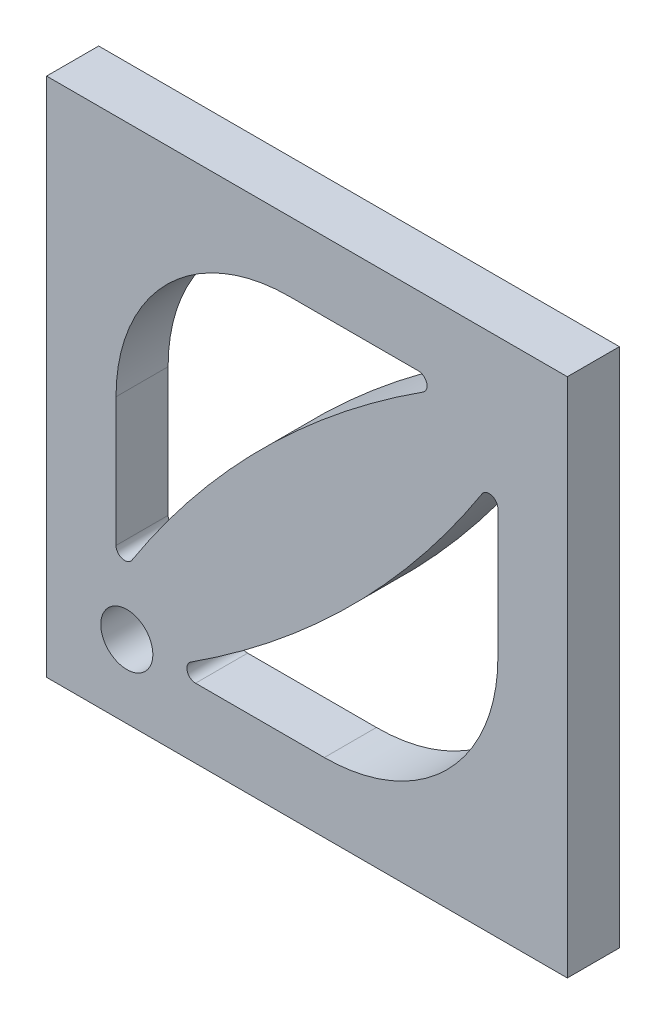
ISO-10303-21;
HEADER;
FILE_DESCRIPTION(('STEP AP214'),'2;1');
FILE_NAME('part.step','',(''),(''),'','','');
FILE_SCHEMA(('AUTOMOTIVE_DESIGN { 1 0 10303 214 1 1 1 1 }'));
ENDSEC;
DATA;
#1=APPLICATION_CONTEXT('core data for automotive mechanical design processes');
#2=APPLICATION_PROTOCOL_DEFINITION('international standard','automotive_design',2000,#1);
#3=PRODUCT_CONTEXT('',#1,'mechanical');
#4=PRODUCT('Part','Part','',(#3));
#5=PRODUCT_RELATED_PRODUCT_CATEGORY('part','',(#4));
#6=PRODUCT_DEFINITION_FORMATION('','',#4);
#7=PRODUCT_DEFINITION_CONTEXT('part definition',#1,'design');
#8=PRODUCT_DEFINITION('design','',#6,#7);
#9=PRODUCT_DEFINITION_SHAPE('','',#8);
#10=(LENGTH_UNIT() NAMED_UNIT(*) SI_UNIT(.MILLI.,.METRE.));
#11=(NAMED_UNIT(*) PLANE_ANGLE_UNIT() SI_UNIT($,.RADIAN.));
#12=(NAMED_UNIT(*) SI_UNIT($,.STERADIAN.) SOLID_ANGLE_UNIT());
#13=UNCERTAINTY_MEASURE_WITH_UNIT(LENGTH_MEASURE(1.E-05),#10,'distance_accuracy_value','');
#14=(GEOMETRIC_REPRESENTATION_CONTEXT(3) GLOBAL_UNCERTAINTY_ASSIGNED_CONTEXT((#13)) GLOBAL_UNIT_ASSIGNED_CONTEXT((#10,
#11,#12)) REPRESENTATION_CONTEXT('',''));
#15=CARTESIAN_POINT('',(0.,0.,0.));
#16=DIRECTION('',(0.,0.,1.));
#17=DIRECTION('',(1.,0.,0.));
#18=AXIS2_PLACEMENT_3D('',#15,#16,#17);
#19=CARTESIAN_POINT('',(0.,0.,3.));
#20=DIRECTION('',(0.,0.,1.));
#21=DIRECTION('',(1.,0.,0.));
#22=AXIS2_PLACEMENT_3D('',#19,#20,#21);
#23=PLANE('',#22);
#24=CARTESIAN_POINT('',(-10.3783024191752,-10.7986075015717,3.));
#25=DIRECTION('',(0.,0.,1.));
#26=DIRECTION('',(1.,0.,0.));
#27=AXIS2_PLACEMENT_3D('',#24,#25,#26);
#28=CIRCLE('',#27,1.5);
#29=CARTESIAN_POINT('',(-8.87830241917519,-10.7986075015717,3.));
#30=VERTEX_POINT('',#29);
#31=EDGE_CURVE('E439',#30,#30,#28,.T.);
#32=ORIENTED_EDGE('',*,*,#31,.F.);
#33=EDGE_LOOP('',(#32));
#34=FACE_BOUND('',#33,.T.);
#35=DIRECTION('',(0.,1.,0.));
#36=VECTOR('',#35,1.);
#37=CARTESIAN_POINT('',(15.,15.,3.));
#38=LINE('',#37,#36);
#39=CARTESIAN_POINT('',(15.,-15.,3.));
#40=VERTEX_POINT('',#39);
#41=CARTESIAN_POINT('',(15.,15.,3.));
#42=VERTEX_POINT('',#41);
#43=EDGE_CURVE('E290',#40,#42,#38,.T.);
#44=ORIENTED_EDGE('',*,*,#43,.T.);
#45=DIRECTION('',(-1.,0.,0.));
#46=VECTOR('',#45,1.);
#47=CARTESIAN_POINT('',(-15.,15.,3.));
#48=LINE('',#47,#46);
#49=CARTESIAN_POINT('',(-15.,15.,3.));
#50=VERTEX_POINT('',#49);
#51=EDGE_CURVE('E294',#42,#50,#48,.T.);
#52=ORIENTED_EDGE('',*,*,#51,.T.);
#53=DIRECTION('',(0.,-1.,0.));
#54=VECTOR('',#53,1.);
#55=CARTESIAN_POINT('',(-15.,15.,3.));
#56=LINE('',#55,#54);
#57=CARTESIAN_POINT('',(-15.,-15.,3.));
#58=VERTEX_POINT('',#57);
#59=EDGE_CURVE('E298',#50,#58,#56,.T.);
#60=ORIENTED_EDGE('',*,*,#59,.T.);
#61=DIRECTION('',(1.,0.,0.));
#62=VECTOR('',#61,1.);
#63=CARTESIAN_POINT('',(-15.,-15.,3.));
#64=LINE('',#63,#62);
#65=EDGE_CURVE('E301',#58,#40,#64,.T.);
#66=ORIENTED_EDGE('',*,*,#65,.T.);
#67=EDGE_LOOP('',(#44,#52,#60,#66));
#68=FACE_BOUND('',#67,.T.);
#69=DIRECTION('',(0.,1.,0.));
#70=VECTOR('',#69,1.);
#71=CARTESIAN_POINT('',(11.,-0.999999999999923,3.));
#72=LINE('',#71,#70);
#73=CARTESIAN_POINT('',(11.,-0.999999999999923,3.));
#74=VERTEX_POINT('',#73);
#75=CARTESIAN_POINT('',(11.,6.4184989585451,3.));
#76=VERTEX_POINT('',#75);
#77=EDGE_CURVE('E230',#74,#76,#72,.T.);
#78=ORIENTED_EDGE('',*,*,#77,.F.);
#79=CARTESIAN_POINT('',(0.999999999999994,-0.999999999999996,3.));
#80=DIRECTION('',(0.,0.,1.));
#81=DIRECTION('',(1.,0.,0.));
#82=AXIS2_PLACEMENT_3D('',#79,#80,#81);
#83=CIRCLE('',#82,10.);
#84=CARTESIAN_POINT('',(0.999999999999921,-11.,3.));
#85=VERTEX_POINT('',#84);
#86=EDGE_CURVE('E227',#85,#74,#83,.T.);
#87=ORIENTED_EDGE('',*,*,#86,.F.);
#88=DIRECTION('',(1.,0.,0.));
#89=VECTOR('',#88,1.);
#90=CARTESIAN_POINT('',(-6.41849895854493,-11.,3.));
#91=LINE('',#90,#89);
#92=CARTESIAN_POINT('',(-6.41849895854493,-11.,3.));
#93=VERTEX_POINT('',#92);
#94=EDGE_CURVE('E244',#93,#85,#91,.T.);
#95=ORIENTED_EDGE('',*,*,#94,.F.);
#96=CARTESIAN_POINT('',(-6.41849895854493,-10.5,3.));
#97=DIRECTION('',(0.,0.,1.));
#98=DIRECTION('',(-1.,0.,0.));
#99=AXIS2_PLACEMENT_3D('',#96,#97,#98);
#100=CIRCLE('',#99,0.500000000000002);
#101=CARTESIAN_POINT('',(-6.68885237713846,-10.0793944495673,3.));
#102=VERTEX_POINT('',#101);
#103=EDGE_CURVE('E240',#102,#93,#100,.T.);
#104=ORIENTED_EDGE('',*,*,#103,.F.);
#105=CARTESIAN_POINT('',(-36.8604898636055,36.8604898636052,3.));
#106=DIRECTION('',(0.,0.,-1.));
#107=DIRECTION('',(-1.,0.,0.));
#108=AXIS2_PLACEMENT_3D('',#105,#106,#107);
#109=CIRCLE('',#108,55.8003624356402);
#110=CARTESIAN_POINT('',(10.0793944495673,6.68885237713862,3.));
#111=VERTEX_POINT('',#110);
#112=EDGE_CURVE('E237',#111,#102,#109,.T.);
#113=ORIENTED_EDGE('',*,*,#112,.F.);
#114=CARTESIAN_POINT('',(10.5,6.4184989585451,3.));
#115=DIRECTION('',(0.,0.,1.));
#116=DIRECTION('',(1.,0.,0.));
#117=AXIS2_PLACEMENT_3D('',#114,#115,#116);
#118=CIRCLE('',#117,0.5);
#119=EDGE_CURVE('E234',#76,#111,#118,.T.);
#120=ORIENTED_EDGE('',*,*,#119,.F.);
#121=EDGE_LOOP('',(#78,#87,#95,#104,#113,#120));
#122=FACE_BOUND('',#121,.T.);
#123=DIRECTION('',(0.,-1.,0.));
#124=VECTOR('',#123,1.);
#125=CARTESIAN_POINT('',(-11.,-6.41849895854493,3.));
#126=LINE('',#125,#124);
#127=CARTESIAN_POINT('',(-11.,0.99999999999993,3.));
#128=VERTEX_POINT('',#127);
#129=CARTESIAN_POINT('',(-11.,-6.41849895854493,3.));
#130=VERTEX_POINT('',#129);
#131=EDGE_CURVE('E165',#128,#130,#126,.T.);
#132=ORIENTED_EDGE('',*,*,#131,.F.);
#133=CARTESIAN_POINT('',(-1.00000000000001,1.,3.));
#134=DIRECTION('',(0.,0.,1.));
#135=DIRECTION('',(1.,0.,0.));
#136=AXIS2_PLACEMENT_3D('',#133,#134,#135);
#137=CIRCLE('',#136,10.);
#138=CARTESIAN_POINT('',(-0.999999999999933,11.,3.));
#139=VERTEX_POINT('',#138);
#140=EDGE_CURVE('E156',#139,#128,#137,.T.);
#141=ORIENTED_EDGE('',*,*,#140,.F.);
#142=DIRECTION('',(-1.,0.,0.));
#143=VECTOR('',#142,1.);
#144=CARTESIAN_POINT('',(-0.999999999999933,11.,3.));
#145=LINE('',#144,#143);
#146=CARTESIAN_POINT('',(6.41849895854507,11.,3.));
#147=VERTEX_POINT('',#146);
#148=EDGE_CURVE('E192',#147,#139,#145,.T.);
#149=ORIENTED_EDGE('',*,*,#148,.F.);
#150=CARTESIAN_POINT('',(6.41849895854508,10.5,3.));
#151=DIRECTION('',(0.,0.,1.));
#152=DIRECTION('',(-1.,0.,0.));
#153=AXIS2_PLACEMENT_3D('',#150,#151,#152);
#154=CIRCLE('',#153,0.5);
#155=CARTESIAN_POINT('',(6.68885237713861,10.0793944495673,3.));
#156=VERTEX_POINT('',#155);
#157=EDGE_CURVE('E189',#156,#147,#154,.T.);
#158=ORIENTED_EDGE('',*,*,#157,.F.);
#159=CARTESIAN_POINT('',(36.8604898636052,-36.8604898636055,3.));
#160=DIRECTION('',(0.,0.,-1.));
#161=DIRECTION('',(1.,0.,0.));
#162=AXIS2_PLACEMENT_3D('',#159,#160,#161);
#163=CIRCLE('',#162,55.8003624356402);
#164=CARTESIAN_POINT('',(-10.0793944495673,-6.68885237713848,3.));
#165=VERTEX_POINT('',#164);
#166=EDGE_CURVE('E183',#165,#156,#163,.T.);
#167=ORIENTED_EDGE('',*,*,#166,.F.);
#168=CARTESIAN_POINT('',(-10.5,-6.41849895854493,3.));
#169=DIRECTION('',(0.,0.,1.));
#170=DIRECTION('',(1.,0.,0.));
#171=AXIS2_PLACEMENT_3D('',#168,#169,#170);
#172=CIRCLE('',#171,0.500000000000002);
#173=EDGE_CURVE('E179',#130,#165,#172,.T.);
#174=ORIENTED_EDGE('',*,*,#173,.F.);
#175=EDGE_LOOP('',(#132,#141,#149,#158,#167,#174));
#176=FACE_BOUND('',#175,.T.);
#177=ADVANCED_FACE('F42',(#34,#68,#122,#176),#23,.T.);
#178=CARTESIAN_POINT('',(0.,0.,0.));
#179=DIRECTION('',(0.,0.,1.));
#180=DIRECTION('',(1.,0.,0.));
#181=AXIS2_PLACEMENT_3D('',#178,#179,#180);
#182=PLANE('',#181);
#183=CARTESIAN_POINT('',(-10.3783024191752,-10.7986075015717,0.));
#184=DIRECTION('',(0.,0.,1.));
#185=DIRECTION('',(1.,0.,0.));
#186=AXIS2_PLACEMENT_3D('',#183,#184,#185);
#187=CIRCLE('',#186,1.5);
#188=CARTESIAN_POINT('',(-8.87830241917519,-10.7986075015717,0.));
#189=VERTEX_POINT('',#188);
#190=EDGE_CURVE('E197',#189,#189,#187,.T.);
#191=ORIENTED_EDGE('',*,*,#190,.T.);
#192=EDGE_LOOP('',(#191));
#193=FACE_BOUND('',#192,.T.);
#194=CARTESIAN_POINT('',(0.999999999999994,-0.999999999999996,0.));
#195=DIRECTION('',(0.,0.,1.));
#196=DIRECTION('',(1.,0.,0.));
#197=AXIS2_PLACEMENT_3D('',#194,#195,#196);
#198=CIRCLE('',#197,10.);
#199=CARTESIAN_POINT('',(0.999999999999921,-11.,0.));
#200=VERTEX_POINT('',#199);
#201=CARTESIAN_POINT('',(11.,-0.999999999999923,0.));
#202=VERTEX_POINT('',#201);
#203=EDGE_CURVE('E174',#200,#202,#198,.T.);
#204=ORIENTED_EDGE('',*,*,#203,.T.);
#205=DIRECTION('',(0.,1.,0.));
#206=VECTOR('',#205,1.);
#207=CARTESIAN_POINT('',(11.,-0.999999999999923,0.));
#208=LINE('',#207,#206);
#209=CARTESIAN_POINT('',(11.,6.4184989585451,0.));
#210=VERTEX_POINT('',#209);
#211=EDGE_CURVE('E251',#202,#210,#208,.T.);
#212=ORIENTED_EDGE('',*,*,#211,.T.);
#213=CARTESIAN_POINT('',(10.5,6.4184989585451,0.));
#214=DIRECTION('',(0.,0.,1.));
#215=DIRECTION('',(1.,0.,0.));
#216=AXIS2_PLACEMENT_3D('',#213,#214,#215);
#217=CIRCLE('',#216,0.5);
#218=CARTESIAN_POINT('',(10.0793944495673,6.68885237713862,0.));
#219=VERTEX_POINT('',#218);
#220=EDGE_CURVE('E255',#210,#219,#217,.T.);
#221=ORIENTED_EDGE('',*,*,#220,.T.);
#222=CARTESIAN_POINT('',(-36.8604898636055,36.8604898636052,0.));
#223=DIRECTION('',(0.,0.,-1.));
#224=DIRECTION('',(-1.,0.,0.));
#225=AXIS2_PLACEMENT_3D('',#222,#223,#224);
#226=CIRCLE('',#225,55.8003624356402);
#227=CARTESIAN_POINT('',(-6.68885237713846,-10.0793944495673,0.));
#228=VERTEX_POINT('',#227);
#229=EDGE_CURVE('E259',#219,#228,#226,.T.);
#230=ORIENTED_EDGE('',*,*,#229,.T.);
#231=CARTESIAN_POINT('',(-6.41849895854493,-10.5,0.));
#232=DIRECTION('',(0.,0.,1.));
#233=DIRECTION('',(-1.,0.,0.));
#234=AXIS2_PLACEMENT_3D('',#231,#232,#233);
#235=CIRCLE('',#234,0.500000000000002);
#236=CARTESIAN_POINT('',(-6.41849895854493,-11.,0.));
#237=VERTEX_POINT('',#236);
#238=EDGE_CURVE('E263',#228,#237,#235,.T.);
#239=ORIENTED_EDGE('',*,*,#238,.T.);
#240=DIRECTION('',(1.,0.,0.));
#241=VECTOR('',#240,1.);
#242=CARTESIAN_POINT('',(-6.41849895854493,-11.,0.));
#243=LINE('',#242,#241);
#244=EDGE_CURVE('E231',#237,#200,#243,.T.);
#245=ORIENTED_EDGE('',*,*,#244,.T.);
#246=EDGE_LOOP('',(#204,#212,#221,#230,#239,#245));
#247=FACE_BOUND('',#246,.T.);
#248=DIRECTION('',(0.,1.,0.));
#249=VECTOR('',#248,1.);
#250=CARTESIAN_POINT('',(15.,15.,0.));
#251=LINE('',#250,#249);
#252=CARTESIAN_POINT('',(15.,-15.,0.));
#253=VERTEX_POINT('',#252);
#254=CARTESIAN_POINT('',(15.,15.,0.));
#255=VERTEX_POINT('',#254);
#256=EDGE_CURVE('E289',#253,#255,#251,.T.);
#257=ORIENTED_EDGE('',*,*,#256,.F.);
#258=DIRECTION('',(1.,0.,0.));
#259=VECTOR('',#258,1.);
#260=CARTESIAN_POINT('',(-15.,-15.,0.));
#261=LINE('',#260,#259);
#262=CARTESIAN_POINT('',(-15.,-15.,0.));
#263=VERTEX_POINT('',#262);
#264=EDGE_CURVE('E295',#263,#253,#261,.T.);
#265=ORIENTED_EDGE('',*,*,#264,.F.);
#266=DIRECTION('',(0.,-1.,0.));
#267=VECTOR('',#266,1.);
#268=CARTESIAN_POINT('',(-15.,15.,0.));
#269=LINE('',#268,#267);
#270=CARTESIAN_POINT('',(-15.,15.,0.));
#271=VERTEX_POINT('',#270);
#272=EDGE_CURVE('E311',#271,#263,#269,.T.);
#273=ORIENTED_EDGE('',*,*,#272,.F.);
#274=DIRECTION('',(-1.,0.,0.));
#275=VECTOR('',#274,1.);
#276=CARTESIAN_POINT('',(-15.,15.,0.));
#277=LINE('',#276,#275);
#278=EDGE_CURVE('E308',#255,#271,#277,.T.);
#279=ORIENTED_EDGE('',*,*,#278,.F.);
#280=EDGE_LOOP('',(#257,#265,#273,#279));
#281=FACE_BOUND('',#280,.T.);
#282=CARTESIAN_POINT('',(-1.00000000000001,1.,0.));
#283=DIRECTION('',(0.,0.,1.));
#284=DIRECTION('',(1.,0.,0.));
#285=AXIS2_PLACEMENT_3D('',#282,#283,#284);
#286=CIRCLE('',#285,10.);
#287=CARTESIAN_POINT('',(-0.999999999999933,11.,0.));
#288=VERTEX_POINT('',#287);
#289=CARTESIAN_POINT('',(-11.,0.99999999999993,0.));
#290=VERTEX_POINT('',#289);
#291=EDGE_CURVE('E66',#288,#290,#286,.T.);
#292=ORIENTED_EDGE('',*,*,#291,.T.);
#293=DIRECTION('',(0.,-1.,0.));
#294=VECTOR('',#293,1.);
#295=CARTESIAN_POINT('',(-11.,-6.41849895854493,0.));
#296=LINE('',#295,#294);
#297=CARTESIAN_POINT('',(-11.,-6.41849895854493,0.));
#298=VERTEX_POINT('',#297);
#299=EDGE_CURVE('E172',#290,#298,#296,.T.);
#300=ORIENTED_EDGE('',*,*,#299,.T.);
#301=CARTESIAN_POINT('',(-10.5,-6.41849895854493,0.));
#302=DIRECTION('',(0.,0.,1.));
#303=DIRECTION('',(1.,0.,0.));
#304=AXIS2_PLACEMENT_3D('',#301,#302,#303);
#305=CIRCLE('',#304,0.500000000000002);
#306=CARTESIAN_POINT('',(-10.0793944495673,-6.68885237713848,0.));
#307=VERTEX_POINT('',#306);
#308=EDGE_CURVE('E200',#298,#307,#305,.T.);
#309=ORIENTED_EDGE('',*,*,#308,.T.);
#310=CARTESIAN_POINT('',(36.8604898636052,-36.8604898636055,0.));
#311=DIRECTION('',(0.,0.,-1.));
#312=DIRECTION('',(1.,0.,0.));
#313=AXIS2_PLACEMENT_3D('',#310,#311,#312);
#314=CIRCLE('',#313,55.8003624356402);
#315=CARTESIAN_POINT('',(6.68885237713861,10.0793944495673,0.));
#316=VERTEX_POINT('',#315);
#317=EDGE_CURVE('E204',#307,#316,#314,.T.);
#318=ORIENTED_EDGE('',*,*,#317,.T.);
#319=CARTESIAN_POINT('',(6.41849895854508,10.5,0.));
#320=DIRECTION('',(0.,0.,1.));
#321=DIRECTION('',(-1.,0.,0.));
#322=AXIS2_PLACEMENT_3D('',#319,#320,#321);
#323=CIRCLE('',#322,0.5);
#324=CARTESIAN_POINT('',(6.41849895854507,11.,0.));
#325=VERTEX_POINT('',#324);
#326=EDGE_CURVE('E208',#316,#325,#323,.T.);
#327=ORIENTED_EDGE('',*,*,#326,.T.);
#328=DIRECTION('',(-1.,0.,0.));
#329=VECTOR('',#328,1.);
#330=CARTESIAN_POINT('',(-0.999999999999933,11.,0.));
#331=LINE('',#330,#329);
#332=EDGE_CURVE('E166',#325,#288,#331,.T.);
#333=ORIENTED_EDGE('',*,*,#332,.T.);
#334=EDGE_LOOP('',(#292,#300,#309,#318,#327,#333));
#335=FACE_BOUND('',#334,.T.);
#336=ADVANCED_FACE('F334',(#193,#247,#281,#335),#182,.F.);
#337=CARTESIAN_POINT('',(15.,15.,3.));
#338=DIRECTION('',(-1.,0.,0.));
#339=DIRECTION('',(0.,0.,1.));
#340=AXIS2_PLACEMENT_3D('',#337,#338,#339);
#341=PLANE('',#340);
#342=ORIENTED_EDGE('',*,*,#256,.T.);
#343=DIRECTION('',(0.,0.,-1.));
#344=VECTOR('',#343,1.);
#345=CARTESIAN_POINT('',(15.,15.,3.));
#346=LINE('',#345,#344);
#347=EDGE_CURVE('E11',#42,#255,#346,.T.);
#348=ORIENTED_EDGE('',*,*,#347,.F.);
#349=ORIENTED_EDGE('',*,*,#43,.F.);
#350=DIRECTION('',(0.,0.,-1.));
#351=VECTOR('',#350,1.);
#352=CARTESIAN_POINT('',(15.,-15.,3.));
#353=LINE('',#352,#351);
#354=EDGE_CURVE('E304',#40,#253,#353,.T.);
#355=ORIENTED_EDGE('',*,*,#354,.T.);
#356=EDGE_LOOP('',(#342,#348,#349,#355));
#357=FACE_BOUND('',#356,.T.);
#358=ADVANCED_FACE('F44',(#357),#341,.F.);
#359=CARTESIAN_POINT('',(-15.,15.,3.));
#360=DIRECTION('',(0.,-1.,0.));
#361=DIRECTION('',(0.,0.,-1.));
#362=AXIS2_PLACEMENT_3D('',#359,#360,#361);
#363=PLANE('',#362);
#364=ORIENTED_EDGE('',*,*,#278,.T.);
#365=DIRECTION('',(0.,0.,-1.));
#366=VECTOR('',#365,1.);
#367=CARTESIAN_POINT('',(-15.,15.,3.));
#368=LINE('',#367,#366);
#369=EDGE_CURVE('E51',#50,#271,#368,.T.);
#370=ORIENTED_EDGE('',*,*,#369,.F.);
#371=ORIENTED_EDGE('',*,*,#51,.F.);
#372=ORIENTED_EDGE('',*,*,#347,.T.);
#373=EDGE_LOOP('',(#364,#370,#371,#372));
#374=FACE_BOUND('',#373,.T.);
#375=ADVANCED_FACE('F345',(#374),#363,.F.);
#376=CARTESIAN_POINT('',(-15.,15.,3.));
#377=DIRECTION('',(1.,0.,0.));
#378=DIRECTION('',(0.,1.,0.));
#379=AXIS2_PLACEMENT_3D('',#376,#377,#378);
#380=PLANE('',#379);
#381=ORIENTED_EDGE('',*,*,#272,.T.);
#382=DIRECTION('',(0.,0.,-1.));
#383=VECTOR('',#382,1.);
#384=CARTESIAN_POINT('',(-15.,-15.,3.));
#385=LINE('',#384,#383);
#386=EDGE_CURVE('E319',#58,#263,#385,.T.);
#387=ORIENTED_EDGE('',*,*,#386,.F.);
#388=ORIENTED_EDGE('',*,*,#59,.F.);
#389=ORIENTED_EDGE('',*,*,#369,.T.);
#390=EDGE_LOOP('',(#381,#387,#388,#389));
#391=FACE_BOUND('',#390,.T.);
#392=ADVANCED_FACE('F328',(#391),#380,.F.);
#393=CARTESIAN_POINT('',(-15.,-15.,3.));
#394=DIRECTION('',(0.,1.,0.));
#395=DIRECTION('',(0.,0.,1.));
#396=AXIS2_PLACEMENT_3D('',#393,#394,#395);
#397=PLANE('',#396);
#398=ORIENTED_EDGE('',*,*,#264,.T.);
#399=ORIENTED_EDGE('',*,*,#354,.F.);
#400=ORIENTED_EDGE('',*,*,#65,.F.);
#401=ORIENTED_EDGE('',*,*,#386,.T.);
#402=EDGE_LOOP('',(#398,#399,#400,#401));
#403=FACE_BOUND('',#402,.T.);
#404=ADVANCED_FACE('F338',(#403),#397,.F.);
#405=CARTESIAN_POINT('',(0.999999999999994,-0.999999999999996,3.));
#406=DIRECTION('',(0.,0.,-1.));
#407=DIRECTION('',(-1.,0.,0.));
#408=AXIS2_PLACEMENT_3D('',#405,#406,#407);
#409=CYLINDRICAL_SURFACE('',#408,10.);
#410=ORIENTED_EDGE('',*,*,#203,.F.);
#411=DIRECTION('',(0.,0.,-1.));
#412=VECTOR('',#411,1.);
#413=CARTESIAN_POINT('',(0.999999999999921,-11.,3.));
#414=LINE('',#413,#412);
#415=EDGE_CURVE('E247',#85,#200,#414,.T.);
#416=ORIENTED_EDGE('',*,*,#415,.F.);
#417=ORIENTED_EDGE('',*,*,#86,.T.);
#418=DIRECTION('',(0.,0.,-1.));
#419=VECTOR('',#418,1.);
#420=CARTESIAN_POINT('',(11.,-0.999999999999923,3.));
#421=LINE('',#420,#419);
#422=EDGE_CURVE('E285',#74,#202,#421,.T.);
#423=ORIENTED_EDGE('',*,*,#422,.T.);
#424=EDGE_LOOP('',(#410,#416,#417,#423));
#425=FACE_BOUND('',#424,.T.);
#426=ADVANCED_FACE('F363',(#425),#409,.F.);
#427=CARTESIAN_POINT('',(11.,-0.999999999999923,3.));
#428=DIRECTION('',(-1.,0.,0.));
#429=DIRECTION('',(0.,-1.,0.));
#430=AXIS2_PLACEMENT_3D('',#427,#428,#429);
#431=PLANE('',#430);
#432=ORIENTED_EDGE('',*,*,#211,.F.);
#433=ORIENTED_EDGE('',*,*,#422,.F.);
#434=ORIENTED_EDGE('',*,*,#77,.T.);
#435=DIRECTION('',(0.,0.,-1.));
#436=VECTOR('',#435,1.);
#437=CARTESIAN_POINT('',(11.,6.4184989585451,3.));
#438=LINE('',#437,#436);
#439=EDGE_CURVE('E282',#76,#210,#438,.T.);
#440=ORIENTED_EDGE('',*,*,#439,.T.);
#441=EDGE_LOOP('',(#432,#433,#434,#440));
#442=FACE_BOUND('',#441,.T.);
#443=ADVANCED_FACE('F370',(#442),#431,.T.);
#444=CARTESIAN_POINT('',(10.5,6.4184989585451,3.));
#445=DIRECTION('',(0.,0.,-1.));
#446=DIRECTION('',(-1.,0.,0.));
#447=AXIS2_PLACEMENT_3D('',#444,#445,#446);
#448=CYLINDRICAL_SURFACE('',#447,0.5);
#449=ORIENTED_EDGE('',*,*,#220,.F.);
#450=ORIENTED_EDGE('',*,*,#439,.F.);
#451=ORIENTED_EDGE('',*,*,#119,.T.);
#452=DIRECTION('',(0.,0.,-1.));
#453=VECTOR('',#452,1.);
#454=CARTESIAN_POINT('',(10.0793944495673,6.68885237713862,3.));
#455=LINE('',#454,#453);
#456=EDGE_CURVE('E279',#111,#219,#455,.T.);
#457=ORIENTED_EDGE('',*,*,#456,.T.);
#458=EDGE_LOOP('',(#449,#450,#451,#457));
#459=FACE_BOUND('',#458,.T.);
#460=ADVANCED_FACE('F375',(#459),#448,.F.);
#461=CARTESIAN_POINT('',(-36.8604898636055,36.8604898636052,3.));
#462=DIRECTION('',(0.,0.,-1.));
#463=DIRECTION('',(-1.,0.,0.));
#464=AXIS2_PLACEMENT_3D('',#461,#462,#463);
#465=CYLINDRICAL_SURFACE('',#464,55.8003624356402);
#466=ORIENTED_EDGE('',*,*,#229,.F.);
#467=ORIENTED_EDGE('',*,*,#456,.F.);
#468=ORIENTED_EDGE('',*,*,#112,.T.);
#469=DIRECTION('',(0.,0.,-1.));
#470=VECTOR('',#469,1.);
#471=CARTESIAN_POINT('',(-6.68885237713846,-10.0793944495673,3.));
#472=LINE('',#471,#470);
#473=EDGE_CURVE('E276',#102,#228,#472,.T.);
#474=ORIENTED_EDGE('',*,*,#473,.T.);
#475=EDGE_LOOP('',(#466,#467,#468,#474));
#476=FACE_BOUND('',#475,.T.);
#477=ADVANCED_FACE('F399',(#476),#465,.T.);
#478=CARTESIAN_POINT('',(-6.41849895854493,-10.5,3.));
#479=DIRECTION('',(0.,0.,-1.));
#480=DIRECTION('',(-1.,0.,0.));
#481=AXIS2_PLACEMENT_3D('',#478,#479,#480);
#482=CYLINDRICAL_SURFACE('',#481,0.500000000000002);
#483=ORIENTED_EDGE('',*,*,#238,.F.);
#484=ORIENTED_EDGE('',*,*,#473,.F.);
#485=ORIENTED_EDGE('',*,*,#103,.T.);
#486=DIRECTION('',(0.,0.,-1.));
#487=VECTOR('',#486,1.);
#488=CARTESIAN_POINT('',(-6.41849895854493,-11.,3.));
#489=LINE('',#488,#487);
#490=EDGE_CURVE('E273',#93,#237,#489,.T.);
#491=ORIENTED_EDGE('',*,*,#490,.T.);
#492=EDGE_LOOP('',(#483,#484,#485,#491));
#493=FACE_BOUND('',#492,.T.);
#494=ADVANCED_FACE('F389',(#493),#482,.F.);
#495=CARTESIAN_POINT('',(-6.41849895854493,-11.,3.));
#496=DIRECTION('',(0.,1.,0.));
#497=DIRECTION('',(-1.,0.,0.));
#498=AXIS2_PLACEMENT_3D('',#495,#496,#497);
#499=PLANE('',#498);
#500=ORIENTED_EDGE('',*,*,#244,.F.);
#501=ORIENTED_EDGE('',*,*,#490,.F.);
#502=ORIENTED_EDGE('',*,*,#94,.T.);
#503=ORIENTED_EDGE('',*,*,#415,.T.);
#504=EDGE_LOOP('',(#500,#501,#502,#503));
#505=FACE_BOUND('',#504,.T.);
#506=ADVANCED_FACE('F383',(#505),#499,.T.);
#507=CARTESIAN_POINT('',(-1.00000000000001,1.,3.));
#508=DIRECTION('',(0.,0.,-1.));
#509=DIRECTION('',(-1.,0.,0.));
#510=AXIS2_PLACEMENT_3D('',#507,#508,#509);
#511=CYLINDRICAL_SURFACE('',#510,10.);
#512=ORIENTED_EDGE('',*,*,#291,.F.);
#513=DIRECTION('',(0.,0.,-1.));
#514=VECTOR('',#513,1.);
#515=CARTESIAN_POINT('',(-0.999999999999933,11.,3.));
#516=LINE('',#515,#514);
#517=EDGE_CURVE('E160',#139,#288,#516,.T.);
#518=ORIENTED_EDGE('',*,*,#517,.F.);
#519=ORIENTED_EDGE('',*,*,#140,.T.);
#520=DIRECTION('',(0.,0.,-1.));
#521=VECTOR('',#520,1.);
#522=CARTESIAN_POINT('',(-11.,0.99999999999993,3.));
#523=LINE('',#522,#521);
#524=EDGE_CURVE('E159',#128,#290,#523,.T.);
#525=ORIENTED_EDGE('',*,*,#524,.T.);
#526=EDGE_LOOP('',(#512,#518,#519,#525));
#527=FACE_BOUND('',#526,.T.);
#528=ADVANCED_FACE('F158',(#527),#511,.F.);
#529=CARTESIAN_POINT('',(-11.,-6.41849895854493,3.));
#530=DIRECTION('',(1.,0.,0.));
#531=DIRECTION('',(0.,1.,0.));
#532=AXIS2_PLACEMENT_3D('',#529,#530,#531);
#533=PLANE('',#532);
#534=ORIENTED_EDGE('',*,*,#299,.F.);
#535=ORIENTED_EDGE('',*,*,#524,.F.);
#536=ORIENTED_EDGE('',*,*,#131,.T.);
#537=DIRECTION('',(0.,0.,-1.));
#538=VECTOR('',#537,1.);
#539=CARTESIAN_POINT('',(-11.,-6.41849895854493,3.));
#540=LINE('',#539,#538);
#541=EDGE_CURVE('E175',#130,#298,#540,.T.);
#542=ORIENTED_EDGE('',*,*,#541,.T.);
#543=EDGE_LOOP('',(#534,#535,#536,#542));
#544=FACE_BOUND('',#543,.T.);
#545=ADVANCED_FACE('F169',(#544),#533,.T.);
#546=CARTESIAN_POINT('',(-10.5,-6.41849895854493,3.));
#547=DIRECTION('',(0.,0.,-1.));
#548=DIRECTION('',(-1.,0.,0.));
#549=AXIS2_PLACEMENT_3D('',#546,#547,#548);
#550=CYLINDRICAL_SURFACE('',#549,0.500000000000002);
#551=ORIENTED_EDGE('',*,*,#308,.F.);
#552=ORIENTED_EDGE('',*,*,#541,.F.);
#553=ORIENTED_EDGE('',*,*,#173,.T.);
#554=DIRECTION('',(0.,0.,-1.));
#555=VECTOR('',#554,1.);
#556=CARTESIAN_POINT('',(-10.0793944495673,-6.68885237713848,3.));
#557=LINE('',#556,#555);
#558=EDGE_CURVE('E222',#165,#307,#557,.T.);
#559=ORIENTED_EDGE('',*,*,#558,.T.);
#560=EDGE_LOOP('',(#551,#552,#553,#559));
#561=FACE_BOUND('',#560,.T.);
#562=ADVANCED_FACE('F415',(#561),#550,.F.);
#563=CARTESIAN_POINT('',(36.8604898636052,-36.8604898636055,3.));
#564=DIRECTION('',(0.,0.,-1.));
#565=DIRECTION('',(-1.,0.,0.));
#566=AXIS2_PLACEMENT_3D('',#563,#564,#565);
#567=CYLINDRICAL_SURFACE('',#566,55.8003624356402);
#568=ORIENTED_EDGE('',*,*,#317,.F.);
#569=ORIENTED_EDGE('',*,*,#558,.F.);
#570=ORIENTED_EDGE('',*,*,#166,.T.);
#571=DIRECTION('',(0.,0.,-1.));
#572=VECTOR('',#571,1.);
#573=CARTESIAN_POINT('',(6.68885237713861,10.0793944495673,3.));
#574=LINE('',#573,#572);
#575=EDGE_CURVE('E219',#156,#316,#574,.T.);
#576=ORIENTED_EDGE('',*,*,#575,.T.);
#577=EDGE_LOOP('',(#568,#569,#570,#576));
#578=FACE_BOUND('',#577,.T.);
#579=ADVANCED_FACE('F418',(#578),#567,.T.);
#580=CARTESIAN_POINT('',(6.41849895854508,10.5,3.));
#581=DIRECTION('',(0.,0.,-1.));
#582=DIRECTION('',(-1.,0.,0.));
#583=AXIS2_PLACEMENT_3D('',#580,#581,#582);
#584=CYLINDRICAL_SURFACE('',#583,0.5);
#585=ORIENTED_EDGE('',*,*,#326,.F.);
#586=ORIENTED_EDGE('',*,*,#575,.F.);
#587=ORIENTED_EDGE('',*,*,#157,.T.);
#588=DIRECTION('',(0.,0.,-1.));
#589=VECTOR('',#588,1.);
#590=CARTESIAN_POINT('',(6.41849895854507,11.,3.));
#591=LINE('',#590,#589);
#592=EDGE_CURVE('E58',#147,#325,#591,.T.);
#593=ORIENTED_EDGE('',*,*,#592,.T.);
#594=EDGE_LOOP('',(#585,#586,#587,#593));
#595=FACE_BOUND('',#594,.T.);
#596=ADVANCED_FACE('F422',(#595),#584,.F.);
#597=CARTESIAN_POINT('',(-0.999999999999933,11.,3.));
#598=DIRECTION('',(0.,-1.,0.));
#599=DIRECTION('',(1.,0.,0.));
#600=AXIS2_PLACEMENT_3D('',#597,#598,#599);
#601=PLANE('',#600);
#602=ORIENTED_EDGE('',*,*,#332,.F.);
#603=ORIENTED_EDGE('',*,*,#592,.F.);
#604=ORIENTED_EDGE('',*,*,#148,.T.);
#605=ORIENTED_EDGE('',*,*,#517,.T.);
#606=EDGE_LOOP('',(#602,#603,#604,#605));
#607=FACE_BOUND('',#606,.T.);
#608=ADVANCED_FACE('F426',(#607),#601,.T.);
#609=CARTESIAN_POINT('',(-10.3783024191752,-10.7986075015717,0.));
#610=DIRECTION('',(0.,0.,1.));
#611=DIRECTION('',(1.,0.,0.));
#612=AXIS2_PLACEMENT_3D('',#609,#610,#611);
#613=CYLINDRICAL_SURFACE('',#612,1.5);
#614=ORIENTED_EDGE('',*,*,#190,.F.);
#615=EDGE_LOOP('',(#614));
#616=FACE_BOUND('',#615,.T.);
#617=ORIENTED_EDGE('',*,*,#31,.T.);
#618=EDGE_LOOP('',(#617));
#619=FACE_BOUND('',#618,.T.);
#620=ADVANCED_FACE('F430',(#616,#619),#613,.F.);
#621=CLOSED_SHELL('',(#177,#336,#358,#375,#392,#404,#426,#443,#460,#477,#494,#506,#528,#545,
#562,#579,#596,#608,#620));
#622=MANIFOLD_SOLID_BREP('B2',#621);
#623=ADVANCED_BREP_SHAPE_REPRESENTATION('',(#18,#622),#14);
#624=SHAPE_DEFINITION_REPRESENTATION(#9,#623);
ENDSEC;
END-ISO-10303-21;
